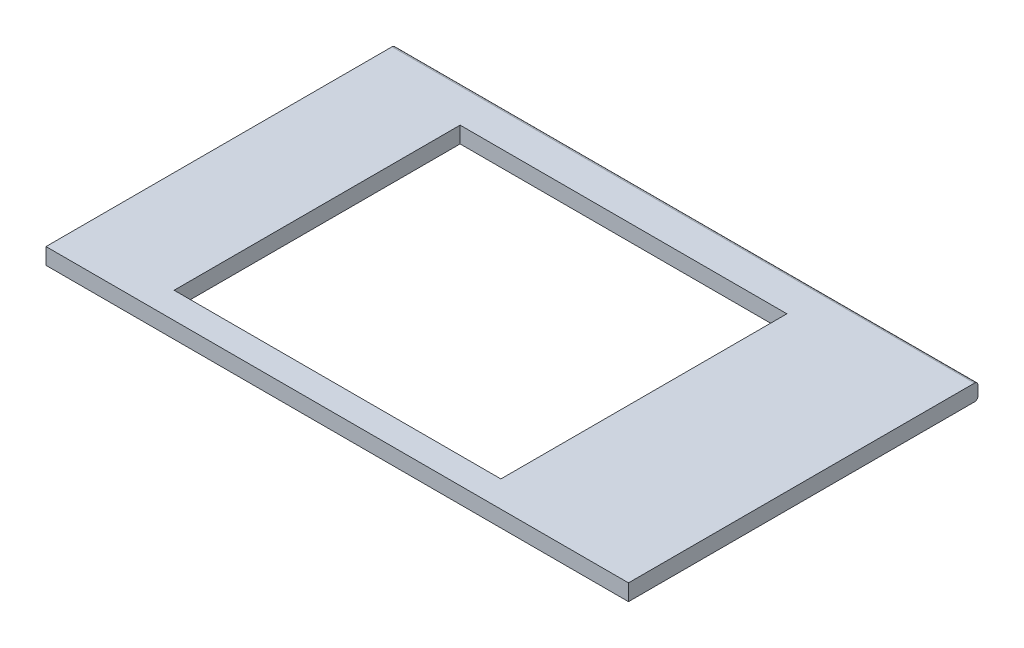
ISO-10303-21;
HEADER;
FILE_DESCRIPTION(('STEP AP214'),'2;1');
FILE_NAME('part.step','',(''),(''),'','','');
FILE_SCHEMA(('AUTOMOTIVE_DESIGN { 1 0 10303 214 1 1 1 1 }'));
ENDSEC;
DATA;
#1=APPLICATION_CONTEXT('core data for automotive mechanical design processes');
#2=APPLICATION_PROTOCOL_DEFINITION('international standard','automotive_design',2000,#1);
#3=PRODUCT_CONTEXT('',#1,'mechanical');
#4=PRODUCT('Part','Part','',(#3));
#5=PRODUCT_RELATED_PRODUCT_CATEGORY('part','',(#4));
#6=PRODUCT_DEFINITION_FORMATION('','',#4);
#7=PRODUCT_DEFINITION_CONTEXT('part definition',#1,'design');
#8=PRODUCT_DEFINITION('design','',#6,#7);
#9=PRODUCT_DEFINITION_SHAPE('','',#8);
#10=(LENGTH_UNIT() NAMED_UNIT(*) SI_UNIT(.MILLI.,.METRE.));
#11=(NAMED_UNIT(*) PLANE_ANGLE_UNIT() SI_UNIT($,.RADIAN.));
#12=(NAMED_UNIT(*) SI_UNIT($,.STERADIAN.) SOLID_ANGLE_UNIT());
#13=UNCERTAINTY_MEASURE_WITH_UNIT(LENGTH_MEASURE(1.E-05),#10,'distance_accuracy_value','');
#14=(GEOMETRIC_REPRESENTATION_CONTEXT(3) GLOBAL_UNCERTAINTY_ASSIGNED_CONTEXT((#13)) GLOBAL_UNIT_ASSIGNED_CONTEXT((#10,
#11,#12)) REPRESENTATION_CONTEXT('',''));
#15=CARTESIAN_POINT('',(0.,0.,0.));
#16=DIRECTION('',(0.,0.,1.));
#17=DIRECTION('',(1.,0.,0.));
#18=AXIS2_PLACEMENT_3D('',#15,#16,#17);
#19=CARTESIAN_POINT('',(1000.,0.,0.));
#20=DIRECTION('',(0.,0.,-1.));
#21=DIRECTION('',(-1.,0.,0.));
#22=AXIS2_PLACEMENT_3D('',#19,#20,#21);
#23=PLANE('',#22);
#24=DIRECTION('',(0.,-1.,0.));
#25=VECTOR('',#24,1.);
#26=CARTESIAN_POINT('',(0.,0.,0.));
#27=LINE('',#26,#25);
#28=CARTESIAN_POINT('',(0.,28.,0.));
#29=VERTEX_POINT('',#28);
#30=CARTESIAN_POINT('',(0.,0.,0.));
#31=VERTEX_POINT('',#30);
#32=EDGE_CURVE('E159',#29,#31,#27,.T.);
#33=ORIENTED_EDGE('',*,*,#32,.T.);
#34=DIRECTION('',(-1.,0.,0.));
#35=VECTOR('',#34,1.);
#36=CARTESIAN_POINT('',(1000.,0.,0.));
#37=LINE('',#36,#35);
#38=CARTESIAN_POINT('',(1000.,0.,0.));
#39=VERTEX_POINT('',#38);
#40=EDGE_CURVE('E11',#39,#31,#37,.T.);
#41=ORIENTED_EDGE('',*,*,#40,.F.);
#42=DIRECTION('',(0.,-1.,0.));
#43=VECTOR('',#42,1.);
#44=CARTESIAN_POINT('',(1000.,0.,0.));
#45=LINE('',#44,#43);
#46=CARTESIAN_POINT('',(1000.,28.,0.));
#47=VERTEX_POINT('',#46);
#48=EDGE_CURVE('E165',#47,#39,#45,.T.);
#49=ORIENTED_EDGE('',*,*,#48,.F.);
#50=DIRECTION('',(-1.,0.,0.));
#51=VECTOR('',#50,1.);
#52=CARTESIAN_POINT('',(1000.,28.,0.));
#53=LINE('',#52,#51);
#54=EDGE_CURVE('E185',#47,#29,#53,.T.);
#55=ORIENTED_EDGE('',*,*,#54,.T.);
#56=EDGE_LOOP('',(#33,#41,#49,#55));
#57=FACE_BOUND('',#56,.T.);
#58=ADVANCED_FACE('F39',(#57),#23,.F.);
#59=CARTESIAN_POINT('',(1000.,0.,0.));
#60=DIRECTION('',(0.,1.,0.));
#61=DIRECTION('',(0.,0.,1.));
#62=AXIS2_PLACEMENT_3D('',#59,#60,#61);
#63=PLANE('',#62);
#64=DIRECTION('',(-1.,0.,0.));
#65=VECTOR('',#64,1.);
#66=CARTESIAN_POINT('',(174.938358962816,0.,-536.));
#67=LINE('',#66,#65);
#68=CARTESIAN_POINT('',(735.938358962816,0.,-536.));
#69=VERTEX_POINT('',#68);
#70=CARTESIAN_POINT('',(174.938358962816,0.,-536.));
#71=VERTEX_POINT('',#70);
#72=EDGE_CURVE('E125',#69,#71,#67,.T.);
#73=ORIENTED_EDGE('',*,*,#72,.T.);
#74=DIRECTION('',(0.,0.,1.));
#75=VECTOR('',#74,1.);
#76=CARTESIAN_POINT('',(174.938358962816,0.,-536.));
#77=LINE('',#76,#75);
#78=CARTESIAN_POINT('',(174.938358962816,0.,-45.));
#79=VERTEX_POINT('',#78);
#80=EDGE_CURVE('E118',#71,#79,#77,.T.);
#81=ORIENTED_EDGE('',*,*,#80,.T.);
#82=DIRECTION('',(1.,0.,0.));
#83=VECTOR('',#82,1.);
#84=CARTESIAN_POINT('',(174.938358962816,0.,-45.));
#85=LINE('',#84,#83);
#86=CARTESIAN_POINT('',(735.938358962816,0.,-45.));
#87=VERTEX_POINT('',#86);
#88=EDGE_CURVE('E128',#79,#87,#85,.T.);
#89=ORIENTED_EDGE('',*,*,#88,.T.);
#90=DIRECTION('',(0.,0.,-1.));
#91=VECTOR('',#90,1.);
#92=CARTESIAN_POINT('',(735.938358962816,0.,-536.));
#93=LINE('',#92,#91);
#94=EDGE_CURVE('E54',#87,#69,#93,.T.);
#95=ORIENTED_EDGE('',*,*,#94,.T.);
#96=EDGE_LOOP('',(#73,#81,#89,#95));
#97=FACE_BOUND('',#96,.T.);
#98=DIRECTION('',(0.,0.,-1.));
#99=VECTOR('',#98,1.);
#100=CARTESIAN_POINT('',(0.,0.,0.));
#101=LINE('',#100,#99);
#102=CARTESIAN_POINT('',(0.,0.,-594.));
#103=VERTEX_POINT('',#102);
#104=EDGE_CURVE('E189',#31,#103,#101,.T.);
#105=ORIENTED_EDGE('',*,*,#104,.T.);
#106=DIRECTION('',(-1.,0.,0.));
#107=VECTOR('',#106,1.);
#108=CARTESIAN_POINT('',(1000.,0.,-594.));
#109=LINE('',#108,#107);
#110=CARTESIAN_POINT('',(1000.,0.,-594.));
#111=VERTEX_POINT('',#110);
#112=EDGE_CURVE('E47',#111,#103,#109,.T.);
#113=ORIENTED_EDGE('',*,*,#112,.F.);
#114=DIRECTION('',(0.,0.,-1.));
#115=VECTOR('',#114,1.);
#116=CARTESIAN_POINT('',(1000.,0.,0.));
#117=LINE('',#116,#115);
#118=EDGE_CURVE('E169',#39,#111,#117,.T.);
#119=ORIENTED_EDGE('',*,*,#118,.F.);
#120=ORIENTED_EDGE('',*,*,#40,.T.);
#121=EDGE_LOOP('',(#105,#113,#119,#120));
#122=FACE_BOUND('',#121,.T.);
#123=ADVANCED_FACE('F133',(#97,#122),#63,.F.);
#124=CARTESIAN_POINT('',(1000.,6.,-594.));
#125=DIRECTION('',(-1.,0.,0.));
#126=DIRECTION('',(0.,0.,1.));
#127=AXIS2_PLACEMENT_3D('',#124,#125,#126);
#128=CYLINDRICAL_SURFACE('',#127,6.);
#129=CARTESIAN_POINT('',(0.,6.,-594.));
#130=DIRECTION('',(1.,0.,0.));
#131=DIRECTION('',(0.,0.,-1.));
#132=AXIS2_PLACEMENT_3D('',#129,#130,#131);
#133=CIRCLE('',#132,6.);
#134=CARTESIAN_POINT('',(0.,6.,-600.));
#135=VERTEX_POINT('',#134);
#136=EDGE_CURVE('E192',#103,#135,#133,.T.);
#137=ORIENTED_EDGE('',*,*,#136,.T.);
#138=DIRECTION('',(-1.,0.,0.));
#139=VECTOR('',#138,1.);
#140=CARTESIAN_POINT('',(1000.,6.,-600.));
#141=LINE('',#140,#139);
#142=CARTESIAN_POINT('',(1000.,6.,-600.));
#143=VERTEX_POINT('',#142);
#144=EDGE_CURVE('E214',#143,#135,#141,.T.);
#145=ORIENTED_EDGE('',*,*,#144,.F.);
#146=CARTESIAN_POINT('',(1000.,6.,-594.));
#147=DIRECTION('',(1.,0.,0.));
#148=DIRECTION('',(0.,0.,-1.));
#149=AXIS2_PLACEMENT_3D('',#146,#147,#148);
#150=CIRCLE('',#149,6.);
#151=EDGE_CURVE('E173',#111,#143,#150,.T.);
#152=ORIENTED_EDGE('',*,*,#151,.F.);
#153=ORIENTED_EDGE('',*,*,#112,.T.);
#154=EDGE_LOOP('',(#137,#145,#152,#153));
#155=FACE_BOUND('',#154,.T.);
#156=ADVANCED_FACE('F223',(#155),#128,.T.);
#157=CARTESIAN_POINT('',(1000.,22.,-600.));
#158=DIRECTION('',(0.,0.,1.));
#159=DIRECTION('',(1.,0.,0.));
#160=AXIS2_PLACEMENT_3D('',#157,#158,#159);
#161=PLANE('',#160);
#162=DIRECTION('',(0.,1.,0.));
#163=VECTOR('',#162,1.);
#164=CARTESIAN_POINT('',(0.,22.,-600.));
#165=LINE('',#164,#163);
#166=CARTESIAN_POINT('',(0.,22.,-600.));
#167=VERTEX_POINT('',#166);
#168=EDGE_CURVE('E195',#135,#167,#165,.T.);
#169=ORIENTED_EDGE('',*,*,#168,.T.);
#170=DIRECTION('',(-1.,0.,0.));
#171=VECTOR('',#170,1.);
#172=CARTESIAN_POINT('',(1000.,22.,-600.));
#173=LINE('',#172,#171);
#174=CARTESIAN_POINT('',(1000.,22.,-600.));
#175=VERTEX_POINT('',#174);
#176=EDGE_CURVE('E210',#175,#167,#173,.T.);
#177=ORIENTED_EDGE('',*,*,#176,.F.);
#178=DIRECTION('',(0.,1.,0.));
#179=VECTOR('',#178,1.);
#180=CARTESIAN_POINT('',(1000.,22.,-600.));
#181=LINE('',#180,#179);
#182=EDGE_CURVE('E176',#143,#175,#181,.T.);
#183=ORIENTED_EDGE('',*,*,#182,.F.);
#184=ORIENTED_EDGE('',*,*,#144,.T.);
#185=EDGE_LOOP('',(#169,#177,#183,#184));
#186=FACE_BOUND('',#185,.T.);
#187=ADVANCED_FACE('F233',(#186),#161,.F.);
#188=CARTESIAN_POINT('',(1000.,22.,-594.));
#189=DIRECTION('',(-1.,0.,0.));
#190=DIRECTION('',(0.,0.,1.));
#191=AXIS2_PLACEMENT_3D('',#188,#189,#190);
#192=CYLINDRICAL_SURFACE('',#191,6.);
#193=CARTESIAN_POINT('',(0.,22.,-594.));
#194=DIRECTION('',(1.,0.,0.));
#195=DIRECTION('',(0.,0.,-1.));
#196=AXIS2_PLACEMENT_3D('',#193,#194,#195);
#197=CIRCLE('',#196,6.);
#198=CARTESIAN_POINT('',(0.,28.,-594.));
#199=VERTEX_POINT('',#198);
#200=EDGE_CURVE('E198',#167,#199,#197,.T.);
#201=ORIENTED_EDGE('',*,*,#200,.T.);
#202=DIRECTION('',(-1.,0.,0.));
#203=VECTOR('',#202,1.);
#204=CARTESIAN_POINT('',(1000.,28.,-594.));
#205=LINE('',#204,#203);
#206=CARTESIAN_POINT('',(1000.,28.,-594.));
#207=VERTEX_POINT('',#206);
#208=EDGE_CURVE('E206',#207,#199,#205,.T.);
#209=ORIENTED_EDGE('',*,*,#208,.F.);
#210=CARTESIAN_POINT('',(1000.,22.,-594.));
#211=DIRECTION('',(1.,0.,0.));
#212=DIRECTION('',(0.,0.,-1.));
#213=AXIS2_PLACEMENT_3D('',#210,#211,#212);
#214=CIRCLE('',#213,6.);
#215=EDGE_CURVE('E179',#175,#207,#214,.T.);
#216=ORIENTED_EDGE('',*,*,#215,.F.);
#217=ORIENTED_EDGE('',*,*,#176,.T.);
#218=EDGE_LOOP('',(#201,#209,#216,#217));
#219=FACE_BOUND('',#218,.T.);
#220=ADVANCED_FACE('F237',(#219),#192,.T.);
#221=CARTESIAN_POINT('',(1000.,28.,0.));
#222=DIRECTION('',(0.,-1.,0.));
#223=DIRECTION('',(0.,0.,-1.));
#224=AXIS2_PLACEMENT_3D('',#221,#222,#223);
#225=PLANE('',#224);
#226=DIRECTION('',(1.,0.,0.));
#227=VECTOR('',#226,1.);
#228=CARTESIAN_POINT('',(174.938358962816,28.,-45.));
#229=LINE('',#228,#227);
#230=CARTESIAN_POINT('',(174.938358962816,28.,-45.));
#231=VERTEX_POINT('',#230);
#232=CARTESIAN_POINT('',(735.938358962816,28.,-45.));
#233=VERTEX_POINT('',#232);
#234=EDGE_CURVE('E150',#231,#233,#229,.T.);
#235=ORIENTED_EDGE('',*,*,#234,.F.);
#236=DIRECTION('',(0.,0.,1.));
#237=VECTOR('',#236,1.);
#238=CARTESIAN_POINT('',(174.938358962816,28.,-536.));
#239=LINE('',#238,#237);
#240=CARTESIAN_POINT('',(174.938358962816,28.,-536.));
#241=VERTEX_POINT('',#240);
#242=EDGE_CURVE('E62',#241,#231,#239,.T.);
#243=ORIENTED_EDGE('',*,*,#242,.F.);
#244=DIRECTION('',(-1.,0.,0.));
#245=VECTOR('',#244,1.);
#246=CARTESIAN_POINT('',(174.938358962816,28.,-536.));
#247=LINE('',#246,#245);
#248=CARTESIAN_POINT('',(735.938358962816,28.,-536.));
#249=VERTEX_POINT('',#248);
#250=EDGE_CURVE('E137',#249,#241,#247,.T.);
#251=ORIENTED_EDGE('',*,*,#250,.F.);
#252=DIRECTION('',(0.,0.,-1.));
#253=VECTOR('',#252,1.);
#254=CARTESIAN_POINT('',(735.938358962816,28.,-536.));
#255=LINE('',#254,#253);
#256=EDGE_CURVE('E141',#233,#249,#255,.T.);
#257=ORIENTED_EDGE('',*,*,#256,.F.);
#258=EDGE_LOOP('',(#235,#243,#251,#257));
#259=FACE_BOUND('',#258,.T.);
#260=DIRECTION('',(0.,0.,1.));
#261=VECTOR('',#260,1.);
#262=CARTESIAN_POINT('',(0.,28.,0.));
#263=LINE('',#262,#261);
#264=EDGE_CURVE('E170',#199,#29,#263,.T.);
#265=ORIENTED_EDGE('',*,*,#264,.T.);
#266=ORIENTED_EDGE('',*,*,#54,.F.);
#267=DIRECTION('',(0.,0.,1.));
#268=VECTOR('',#267,1.);
#269=CARTESIAN_POINT('',(1000.,28.,0.));
#270=LINE('',#269,#268);
#271=EDGE_CURVE('E182',#207,#47,#270,.T.);
#272=ORIENTED_EDGE('',*,*,#271,.F.);
#273=ORIENTED_EDGE('',*,*,#208,.T.);
#274=EDGE_LOOP('',(#265,#266,#272,#273));
#275=FACE_BOUND('',#274,.T.);
#276=ADVANCED_FACE('F247',(#259,#275),#225,.F.);
#277=CARTESIAN_POINT('',(1000.,22.,-594.));
#278=DIRECTION('',(1.,0.,0.));
#279=DIRECTION('',(0.,0.,-1.));
#280=AXIS2_PLACEMENT_3D('',#277,#278,#279);
#281=PLANE('',#280);
#282=ORIENTED_EDGE('',*,*,#48,.T.);
#283=ORIENTED_EDGE('',*,*,#118,.T.);
#284=ORIENTED_EDGE('',*,*,#151,.T.);
#285=ORIENTED_EDGE('',*,*,#182,.T.);
#286=ORIENTED_EDGE('',*,*,#215,.T.);
#287=ORIENTED_EDGE('',*,*,#271,.T.);
#288=EDGE_LOOP('',(#282,#283,#284,#285,#286,#287));
#289=FACE_BOUND('',#288,.T.);
#290=ADVANCED_FACE('F241',(#289),#281,.T.);
#291=CARTESIAN_POINT('',(0.,22.,-594.));
#292=DIRECTION('',(1.,0.,0.));
#293=DIRECTION('',(0.,0.,-1.));
#294=AXIS2_PLACEMENT_3D('',#291,#292,#293);
#295=PLANE('',#294);
#296=ORIENTED_EDGE('',*,*,#32,.F.);
#297=ORIENTED_EDGE('',*,*,#264,.F.);
#298=ORIENTED_EDGE('',*,*,#200,.F.);
#299=ORIENTED_EDGE('',*,*,#168,.F.);
#300=ORIENTED_EDGE('',*,*,#136,.F.);
#301=ORIENTED_EDGE('',*,*,#104,.F.);
#302=EDGE_LOOP('',(#296,#297,#298,#299,#300,#301));
#303=FACE_BOUND('',#302,.T.);
#304=ADVANCED_FACE('F228',(#303),#295,.F.);
#305=CARTESIAN_POINT('',(174.938358962816,0.,-536.));
#306=DIRECTION('',(-1.,0.,0.));
#307=DIRECTION('',(0.,0.,1.));
#308=AXIS2_PLACEMENT_3D('',#305,#306,#307);
#309=PLANE('',#308);
#310=ORIENTED_EDGE('',*,*,#242,.T.);
#311=DIRECTION('',(0.,1.,0.));
#312=VECTOR('',#311,1.);
#313=CARTESIAN_POINT('',(174.938358962816,0.,-45.));
#314=LINE('',#313,#312);
#315=EDGE_CURVE('E114',#79,#231,#314,.T.);
#316=ORIENTED_EDGE('',*,*,#315,.F.);
#317=ORIENTED_EDGE('',*,*,#80,.F.);
#318=DIRECTION('',(0.,1.,0.));
#319=VECTOR('',#318,1.);
#320=CARTESIAN_POINT('',(174.938358962816,0.,-536.));
#321=LINE('',#320,#319);
#322=EDGE_CURVE('E156',#71,#241,#321,.T.);
#323=ORIENTED_EDGE('',*,*,#322,.T.);
#324=EDGE_LOOP('',(#310,#316,#317,#323));
#325=FACE_BOUND('',#324,.T.);
#326=ADVANCED_FACE('F116',(#325),#309,.F.);
#327=CARTESIAN_POINT('',(174.938358962816,0.,-536.));
#328=DIRECTION('',(0.,0.,-1.));
#329=DIRECTION('',(-1.,0.,0.));
#330=AXIS2_PLACEMENT_3D('',#327,#328,#329);
#331=PLANE('',#330);
#332=ORIENTED_EDGE('',*,*,#250,.T.);
#333=ORIENTED_EDGE('',*,*,#322,.F.);
#334=ORIENTED_EDGE('',*,*,#72,.F.);
#335=DIRECTION('',(0.,1.,0.));
#336=VECTOR('',#335,1.);
#337=CARTESIAN_POINT('',(735.938358962816,0.,-536.));
#338=LINE('',#337,#336);
#339=EDGE_CURVE('E160',#69,#249,#338,.T.);
#340=ORIENTED_EDGE('',*,*,#339,.T.);
#341=EDGE_LOOP('',(#332,#333,#334,#340));
#342=FACE_BOUND('',#341,.T.);
#343=ADVANCED_FACE('F295',(#342),#331,.F.);
#344=CARTESIAN_POINT('',(735.938358962816,0.,-536.));
#345=DIRECTION('',(1.,0.,0.));
#346=DIRECTION('',(0.,0.,-1.));
#347=AXIS2_PLACEMENT_3D('',#344,#345,#346);
#348=PLANE('',#347);
#349=ORIENTED_EDGE('',*,*,#256,.T.);
#350=ORIENTED_EDGE('',*,*,#339,.F.);
#351=ORIENTED_EDGE('',*,*,#94,.F.);
#352=DIRECTION('',(0.,1.,0.));
#353=VECTOR('',#352,1.);
#354=CARTESIAN_POINT('',(735.938358962816,0.,-45.));
#355=LINE('',#354,#353);
#356=EDGE_CURVE('E124',#87,#233,#355,.T.);
#357=ORIENTED_EDGE('',*,*,#356,.T.);
#358=EDGE_LOOP('',(#349,#350,#351,#357));
#359=FACE_BOUND('',#358,.T.);
#360=ADVANCED_FACE('F302',(#359),#348,.F.);
#361=CARTESIAN_POINT('',(174.938358962816,0.,-45.));
#362=DIRECTION('',(0.,0.,1.));
#363=DIRECTION('',(1.,0.,0.));
#364=AXIS2_PLACEMENT_3D('',#361,#362,#363);
#365=PLANE('',#364);
#366=ORIENTED_EDGE('',*,*,#234,.T.);
#367=ORIENTED_EDGE('',*,*,#356,.F.);
#368=ORIENTED_EDGE('',*,*,#88,.F.);
#369=ORIENTED_EDGE('',*,*,#315,.T.);
#370=EDGE_LOOP('',(#366,#367,#368,#369));
#371=FACE_BOUND('',#370,.T.);
#372=ADVANCED_FACE('F129',(#371),#365,.F.);
#373=CLOSED_SHELL('',(#58,#123,#156,#187,#220,#276,#290,#304,#326,#343,#360,#372));
#374=MANIFOLD_SOLID_BREP('B2',#373);
#375=ADVANCED_BREP_SHAPE_REPRESENTATION('',(#18,#374),#14);
#376=SHAPE_DEFINITION_REPRESENTATION(#9,#375);
ENDSEC;
END-ISO-10303-21;
